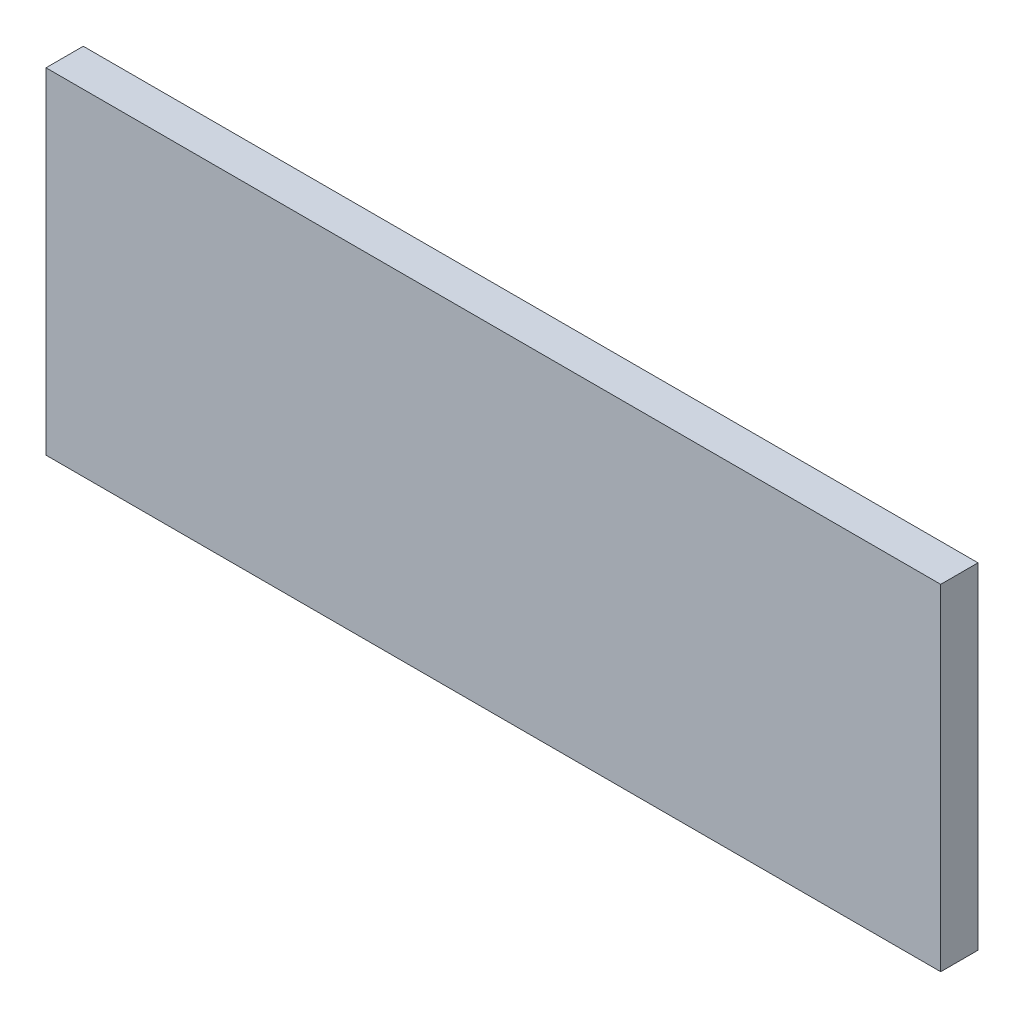
ISO-10303-21;
HEADER;
FILE_DESCRIPTION(('STEP AP214'),'2;1');
FILE_NAME('part.step','',(''),(''),'','','');
FILE_SCHEMA(('AUTOMOTIVE_DESIGN { 1 0 10303 214 1 1 1 1 }'));
ENDSEC;
DATA;
#1=APPLICATION_CONTEXT('core data for automotive mechanical design processes');
#2=APPLICATION_PROTOCOL_DEFINITION('international standard','automotive_design',2000,#1);
#3=PRODUCT_CONTEXT('',#1,'mechanical');
#4=PRODUCT('Part','Part','',(#3));
#5=PRODUCT_RELATED_PRODUCT_CATEGORY('part','',(#4));
#6=PRODUCT_DEFINITION_FORMATION('','',#4);
#7=PRODUCT_DEFINITION_CONTEXT('part definition',#1,'design');
#8=PRODUCT_DEFINITION('design','',#6,#7);
#9=PRODUCT_DEFINITION_SHAPE('','',#8);
#10=(LENGTH_UNIT() NAMED_UNIT(*) SI_UNIT(.MILLI.,.METRE.));
#11=(NAMED_UNIT(*) PLANE_ANGLE_UNIT() SI_UNIT($,.RADIAN.));
#12=(NAMED_UNIT(*) SI_UNIT($,.STERADIAN.) SOLID_ANGLE_UNIT());
#13=UNCERTAINTY_MEASURE_WITH_UNIT(LENGTH_MEASURE(1.E-05),#10,'distance_accuracy_value','');
#14=(GEOMETRIC_REPRESENTATION_CONTEXT(3) GLOBAL_UNCERTAINTY_ASSIGNED_CONTEXT((#13)) GLOBAL_UNIT_ASSIGNED_CONTEXT((#10,
#11,#12)) REPRESENTATION_CONTEXT('',''));
#15=CARTESIAN_POINT('',(0.,0.,0.));
#16=DIRECTION('',(0.,0.,1.));
#17=DIRECTION('',(1.,0.,0.));
#18=AXIS2_PLACEMENT_3D('',#15,#16,#17);
#19=CARTESIAN_POINT('',(0.,0.,-20.57));
#20=DIRECTION('',(0.,0.,-1.));
#21=DIRECTION('',(-1.,0.,0.));
#22=AXIS2_PLACEMENT_3D('',#19,#20,#21);
#23=PLANE('',#22);
#24=DIRECTION('',(1.,0.,0.));
#25=VECTOR('',#24,1.);
#26=CARTESIAN_POINT('',(25.75,-8.25,-20.57));
#27=LINE('',#26,#25);
#28=CARTESIAN_POINT('',(13.75,-8.25,-20.57));
#29=VERTEX_POINT('',#28);
#30=CARTESIAN_POINT('',(25.75,-8.25,-20.57));
#31=VERTEX_POINT('',#30);
#32=EDGE_CURVE('E68',#29,#31,#27,.T.);
#33=ORIENTED_EDGE('',*,*,#32,.F.);
#34=DIRECTION('',(0.,1.,0.));
#35=VECTOR('',#34,1.);
#36=CARTESIAN_POINT('',(13.75,-8.25,-20.57));
#37=LINE('',#36,#35);
#38=CARTESIAN_POINT('',(13.75,-3.75,-20.57));
#39=VERTEX_POINT('',#38);
#40=EDGE_CURVE('E20',#39,#29,#37,.F.);
#41=ORIENTED_EDGE('',*,*,#40,.F.);
#42=DIRECTION('',(1.,0.,0.));
#43=VECTOR('',#42,1.);
#44=CARTESIAN_POINT('',(13.75,-3.75,-20.57));
#45=LINE('',#44,#43);
#46=CARTESIAN_POINT('',(25.75,-3.75,-20.57));
#47=VERTEX_POINT('',#46);
#48=EDGE_CURVE('E58',#47,#39,#45,.F.);
#49=ORIENTED_EDGE('',*,*,#48,.F.);
#50=DIRECTION('',(0.,1.,0.));
#51=VECTOR('',#50,1.);
#52=CARTESIAN_POINT('',(25.75,-3.75,-20.57));
#53=LINE('',#52,#51);
#54=EDGE_CURVE('E53',#31,#47,#53,.T.);
#55=ORIENTED_EDGE('',*,*,#54,.F.);
#56=EDGE_LOOP('',(#33,#41,#49,#55));
#57=FACE_BOUND('',#56,.T.);
#58=ADVANCED_FACE('F17',(#57),#23,.T.);
#59=CARTESIAN_POINT('',(13.75,-8.25,-20.07));
#60=DIRECTION('',(-1.,0.,0.));
#61=DIRECTION('',(0.,0.,1.));
#62=AXIS2_PLACEMENT_3D('',#59,#60,#61);
#63=PLANE('',#62);
#64=DIRECTION('',(0.,0.,-1.));
#65=VECTOR('',#64,1.);
#66=CARTESIAN_POINT('',(13.75,-8.25,-20.07));
#67=LINE('',#66,#65);
#68=CARTESIAN_POINT('',(13.75,-8.25,-20.07));
#69=VERTEX_POINT('',#68);
#70=EDGE_CURVE('E79',#69,#29,#67,.T.);
#71=ORIENTED_EDGE('',*,*,#70,.F.);
#72=DIRECTION('',(0.,1.,0.));
#73=VECTOR('',#72,1.);
#74=CARTESIAN_POINT('',(13.75,0.,-20.07));
#75=LINE('',#74,#73);
#76=CARTESIAN_POINT('',(13.75,-3.75,-20.07));
#77=VERTEX_POINT('',#76);
#78=EDGE_CURVE('E74',#69,#77,#75,.T.);
#79=ORIENTED_EDGE('',*,*,#78,.T.);
#80=DIRECTION('',(0.,0.,1.));
#81=VECTOR('',#80,1.);
#82=CARTESIAN_POINT('',(13.75,-3.75,-20.07));
#83=LINE('',#82,#81);
#84=EDGE_CURVE('E63',#39,#77,#83,.T.);
#85=ORIENTED_EDGE('',*,*,#84,.F.);
#86=ORIENTED_EDGE('',*,*,#40,.T.);
#87=EDGE_LOOP('',(#71,#79,#85,#86));
#88=FACE_BOUND('',#87,.T.);
#89=ADVANCED_FACE('F73',(#88),#63,.T.);
#90=CARTESIAN_POINT('',(13.75,-3.75,-20.07));
#91=DIRECTION('',(0.,1.,0.));
#92=DIRECTION('',(0.,0.,1.));
#93=AXIS2_PLACEMENT_3D('',#90,#91,#92);
#94=PLANE('',#93);
#95=ORIENTED_EDGE('',*,*,#84,.T.);
#96=DIRECTION('',(-1.,0.,0.));
#97=VECTOR('',#96,1.);
#98=CARTESIAN_POINT('',(0.,-3.75,-20.07));
#99=LINE('',#98,#97);
#100=CARTESIAN_POINT('',(25.75,-3.75,-20.07));
#101=VERTEX_POINT('',#100);
#102=EDGE_CURVE('E84',#77,#101,#99,.F.);
#103=ORIENTED_EDGE('',*,*,#102,.T.);
#104=DIRECTION('',(0.,0.,-1.));
#105=VECTOR('',#104,1.);
#106=CARTESIAN_POINT('',(25.75,-3.75,-20.07));
#107=LINE('',#106,#105);
#108=EDGE_CURVE('E65',#47,#101,#107,.F.);
#109=ORIENTED_EDGE('',*,*,#108,.F.);
#110=ORIENTED_EDGE('',*,*,#48,.T.);
#111=EDGE_LOOP('',(#95,#103,#109,#110));
#112=FACE_BOUND('',#111,.T.);
#113=ADVANCED_FACE('F60',(#112),#94,.T.);
#114=CARTESIAN_POINT('',(25.75,-3.75,-20.07));
#115=DIRECTION('',(1.,0.,0.));
#116=DIRECTION('',(0.,0.,-1.));
#117=AXIS2_PLACEMENT_3D('',#114,#115,#116);
#118=PLANE('',#117);
#119=ORIENTED_EDGE('',*,*,#108,.T.);
#120=DIRECTION('',(0.,1.,0.));
#121=VECTOR('',#120,1.);
#122=CARTESIAN_POINT('',(25.75,0.,-20.07));
#123=LINE('',#122,#121);
#124=CARTESIAN_POINT('',(25.75,-8.25,-20.07));
#125=VERTEX_POINT('',#124);
#126=EDGE_CURVE('E26',#101,#125,#123,.F.);
#127=ORIENTED_EDGE('',*,*,#126,.T.);
#128=DIRECTION('',(0.,0.,-1.));
#129=VECTOR('',#128,1.);
#130=CARTESIAN_POINT('',(25.75,-8.25,-20.07));
#131=LINE('',#130,#129);
#132=EDGE_CURVE('E34',#31,#125,#131,.F.);
#133=ORIENTED_EDGE('',*,*,#132,.F.);
#134=ORIENTED_EDGE('',*,*,#54,.T.);
#135=EDGE_LOOP('',(#119,#127,#133,#134));
#136=FACE_BOUND('',#135,.T.);
#137=ADVANCED_FACE('F88',(#136),#118,.T.);
#138=CARTESIAN_POINT('',(25.75,-8.25,-20.07));
#139=DIRECTION('',(0.,-1.,0.));
#140=DIRECTION('',(0.,0.,-1.));
#141=AXIS2_PLACEMENT_3D('',#138,#139,#140);
#142=PLANE('',#141);
#143=ORIENTED_EDGE('',*,*,#132,.T.);
#144=DIRECTION('',(-1.,0.,0.));
#145=VECTOR('',#144,1.);
#146=CARTESIAN_POINT('',(0.,-8.25,-20.07));
#147=LINE('',#146,#145);
#148=EDGE_CURVE('E11',#125,#69,#147,.T.);
#149=ORIENTED_EDGE('',*,*,#148,.T.);
#150=ORIENTED_EDGE('',*,*,#70,.T.);
#151=ORIENTED_EDGE('',*,*,#32,.T.);
#152=EDGE_LOOP('',(#143,#149,#150,#151));
#153=FACE_BOUND('',#152,.T.);
#154=ADVANCED_FACE('F91',(#153),#142,.T.);
#155=CARTESIAN_POINT('',(0.,0.,-20.07));
#156=DIRECTION('',(0.,0.,-1.));
#157=DIRECTION('',(-1.,0.,0.));
#158=AXIS2_PLACEMENT_3D('',#155,#156,#157);
#159=PLANE('',#158);
#160=ORIENTED_EDGE('',*,*,#126,.F.);
#161=ORIENTED_EDGE('',*,*,#102,.F.);
#162=ORIENTED_EDGE('',*,*,#78,.F.);
#163=ORIENTED_EDGE('',*,*,#148,.F.);
#164=EDGE_LOOP('',(#160,#161,#162,#163));
#165=FACE_BOUND('',#164,.T.);
#166=ADVANCED_FACE('F90',(#165),#159,.F.);
#167=CLOSED_SHELL('',(#58,#89,#113,#137,#154,#166));
#168=MANIFOLD_SOLID_BREP('B1',#167);
#169=ADVANCED_BREP_SHAPE_REPRESENTATION('',(#18,#168),#14);
#170=SHAPE_DEFINITION_REPRESENTATION(#9,#169);
ENDSEC;
END-ISO-10303-21;
